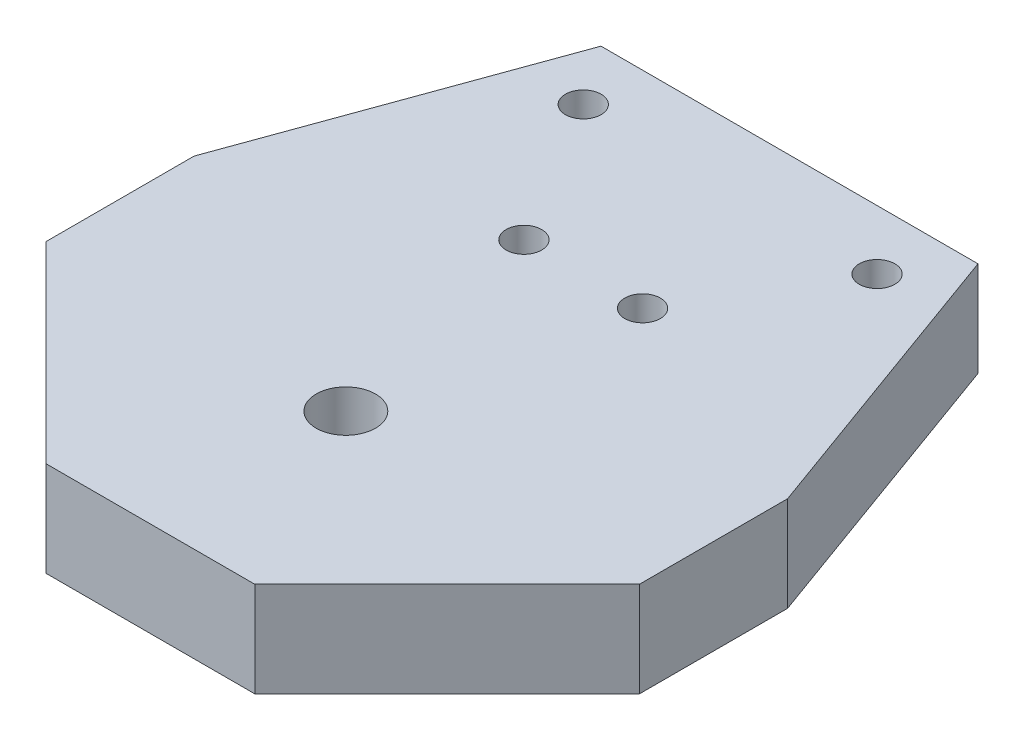
ISO-10303-21;
HEADER;
FILE_DESCRIPTION(('STEP AP214'),'2;1');
FILE_NAME('part.step','',(''),(''),'','','');
FILE_SCHEMA(('AUTOMOTIVE_DESIGN { 1 0 10303 214 1 1 1 1 }'));
ENDSEC;
DATA;
#1=APPLICATION_CONTEXT('core data for automotive mechanical design processes');
#2=APPLICATION_PROTOCOL_DEFINITION('international standard','automotive_design',2000,#1);
#3=PRODUCT_CONTEXT('',#1,'mechanical');
#4=PRODUCT('Part','Part','',(#3));
#5=PRODUCT_RELATED_PRODUCT_CATEGORY('part','',(#4));
#6=PRODUCT_DEFINITION_FORMATION('','',#4);
#7=PRODUCT_DEFINITION_CONTEXT('part definition',#1,'design');
#8=PRODUCT_DEFINITION('design','',#6,#7);
#9=PRODUCT_DEFINITION_SHAPE('','',#8);
#10=(LENGTH_UNIT() NAMED_UNIT(*) SI_UNIT(.MILLI.,.METRE.));
#11=(NAMED_UNIT(*) PLANE_ANGLE_UNIT() SI_UNIT($,.RADIAN.));
#12=(NAMED_UNIT(*) SI_UNIT($,.STERADIAN.) SOLID_ANGLE_UNIT());
#13=UNCERTAINTY_MEASURE_WITH_UNIT(LENGTH_MEASURE(1.E-05),#10,'distance_accuracy_value','');
#14=(GEOMETRIC_REPRESENTATION_CONTEXT(3) GLOBAL_UNCERTAINTY_ASSIGNED_CONTEXT((#13)) GLOBAL_UNIT_ASSIGNED_CONTEXT((#10,
#11,#12)) REPRESENTATION_CONTEXT('',''));
#15=CARTESIAN_POINT('',(0.,0.,0.));
#16=DIRECTION('',(0.,0.,1.));
#17=DIRECTION('',(1.,0.,0.));
#18=AXIS2_PLACEMENT_3D('',#15,#16,#17);
#19=CARTESIAN_POINT('',(0.,8.,0.));
#20=DIRECTION('',(0.,1.,0.));
#21=DIRECTION('',(0.,0.,1.));
#22=AXIS2_PLACEMENT_3D('',#19,#20,#21);
#23=PLANE('',#22);
#24=CARTESIAN_POINT('',(12.3763772695649,8.,-12.378899724008));
#25=DIRECTION('',(0.,1.,0.));
#26=DIRECTION('',(0.,0.,1.));
#27=AXIS2_PLACEMENT_3D('',#24,#25,#26);
#28=CIRCLE('',#27,1.5);
#29=CARTESIAN_POINT('',(12.3763772695649,8.,-10.878899724008));
#30=VERTEX_POINT('',#29);
#31=EDGE_CURVE('E235',#30,#30,#28,.T.);
#32=ORIENTED_EDGE('',*,*,#31,.F.);
#33=EDGE_LOOP('',(#32));
#34=FACE_BOUND('',#33,.T.);
#35=CARTESIAN_POINT('',(5.,8.,0.));
#36=DIRECTION('',(0.,1.,0.));
#37=DIRECTION('',(0.,0.,1.));
#38=AXIS2_PLACEMENT_3D('',#35,#36,#37);
#39=CIRCLE('',#38,1.5);
#40=CARTESIAN_POINT('',(5.,8.,1.5));
#41=VERTEX_POINT('',#40);
#42=EDGE_CURVE('E219',#41,#41,#39,.T.);
#43=ORIENTED_EDGE('',*,*,#42,.F.);
#44=EDGE_LOOP('',(#43));
#45=FACE_BOUND('',#44,.T.);
#46=DIRECTION('',(-0.340738579086975,0.,0.940158082835961));
#47=VECTOR('',#46,1.);
#48=CARTESIAN_POINT('',(-25.0018874247958,8.,7.78311257520442));
#49=LINE('',#48,#47);
#50=CARTESIAN_POINT('',(-15.8824973197398,8.,-17.378899724008));
#51=VERTEX_POINT('',#50);
#52=CARTESIAN_POINT('',(-25.0018874247958,8.,7.78311257520442));
#53=VERTEX_POINT('',#52);
#54=EDGE_CURVE('E170',#51,#53,#49,.T.);
#55=ORIENTED_EDGE('',*,*,#54,.T.);
#56=DIRECTION('',(0.,0.,1.));
#57=VECTOR('',#56,1.);
#58=CARTESIAN_POINT('',(-25.0018874247958,8.,20.2631125752044));
#59=LINE('',#58,#57);
#60=CARTESIAN_POINT('',(-25.0018874247958,8.,20.2631125752044));
#61=VERTEX_POINT('',#60);
#62=EDGE_CURVE('E106',#53,#61,#59,.T.);
#63=ORIENTED_EDGE('',*,*,#62,.T.);
#64=DIRECTION('',(0.707106781186551,0.,0.707106781186544));
#65=VECTOR('',#64,1.);
#66=CARTESIAN_POINT('',(-8.795,8.,36.47));
#67=LINE('',#66,#65);
#68=CARTESIAN_POINT('',(-8.795,8.,36.47));
#69=VERTEX_POINT('',#68);
#70=EDGE_CURVE('E191',#61,#69,#67,.T.);
#71=ORIENTED_EDGE('',*,*,#70,.T.);
#72=DIRECTION('',(1.,0.,0.));
#73=VECTOR('',#72,1.);
#74=CARTESIAN_POINT('',(-8.795,8.,36.47));
#75=LINE('',#74,#73);
#76=CARTESIAN_POINT('',(8.795,8.,36.47));
#77=VERTEX_POINT('',#76);
#78=EDGE_CURVE('E205',#69,#77,#75,.T.);
#79=ORIENTED_EDGE('',*,*,#78,.T.);
#80=DIRECTION('',(0.707106781186551,0.,-0.707106781186544));
#81=VECTOR('',#80,1.);
#82=CARTESIAN_POINT('',(8.795,8.,36.47));
#83=LINE('',#82,#81);
#84=CARTESIAN_POINT('',(25.0018874247958,8.,20.2631125752044));
#85=VERTEX_POINT('',#84);
#86=EDGE_CURVE('E125',#77,#85,#83,.T.);
#87=ORIENTED_EDGE('',*,*,#86,.T.);
#88=DIRECTION('',(0.,0.,-1.));
#89=VECTOR('',#88,1.);
#90=CARTESIAN_POINT('',(25.0018874247958,8.,20.2631125752044));
#91=LINE('',#90,#89);
#92=CARTESIAN_POINT('',(25.0018874247958,8.,7.78311257520442));
#93=VERTEX_POINT('',#92);
#94=EDGE_CURVE('E119',#85,#93,#91,.T.);
#95=ORIENTED_EDGE('',*,*,#94,.T.);
#96=DIRECTION('',(-0.340738579086975,0.,-0.940158082835961));
#97=VECTOR('',#96,1.);
#98=CARTESIAN_POINT('',(25.0018874247958,8.,7.78311257520442));
#99=LINE('',#98,#97);
#100=CARTESIAN_POINT('',(15.8824973197398,8.,-17.378899724008));
#101=VERTEX_POINT('',#100);
#102=EDGE_CURVE('E123',#93,#101,#99,.T.);
#103=ORIENTED_EDGE('',*,*,#102,.T.);
#104=DIRECTION('',(-1.,0.,0.));
#105=VECTOR('',#104,1.);
#106=CARTESIAN_POINT('',(15.8824973197398,8.,-17.378899724008));
#107=LINE('',#106,#105);
#108=EDGE_CURVE('E63',#101,#51,#107,.T.);
#109=ORIENTED_EDGE('',*,*,#108,.T.);
#110=EDGE_LOOP('',(#55,#63,#71,#79,#87,#95,#103,#109));
#111=FACE_BOUND('',#110,.T.);
#112=CARTESIAN_POINT('',(-5.,8.,0.));
#113=DIRECTION('',(0.,1.,0.));
#114=DIRECTION('',(0.,0.,1.));
#115=AXIS2_PLACEMENT_3D('',#112,#113,#114);
#116=CIRCLE('',#115,1.5);
#117=CARTESIAN_POINT('',(-5.,8.,1.5));
#118=VERTEX_POINT('',#117);
#119=EDGE_CURVE('E152',#118,#118,#116,.T.);
#120=ORIENTED_EDGE('',*,*,#119,.F.);
#121=EDGE_LOOP('',(#120));
#122=FACE_BOUND('',#121,.T.);
#123=CARTESIAN_POINT('',(0.,8.,20.));
#124=DIRECTION('',(0.,1.,0.));
#125=DIRECTION('',(0.,0.,1.));
#126=AXIS2_PLACEMENT_3D('',#123,#124,#125);
#127=CIRCLE('',#126,2.5);
#128=CARTESIAN_POINT('',(0.,8.,22.5));
#129=VERTEX_POINT('',#128);
#130=EDGE_CURVE('E227',#129,#129,#127,.T.);
#131=ORIENTED_EDGE('',*,*,#130,.F.);
#132=EDGE_LOOP('',(#131));
#133=FACE_BOUND('',#132,.T.);
#134=CARTESIAN_POINT('',(-12.3763772695649,8.,-12.378899724008));
#135=DIRECTION('',(0.,1.,0.));
#136=DIRECTION('',(0.,0.,-1.));
#137=AXIS2_PLACEMENT_3D('',#134,#135,#136);
#138=CIRCLE('',#137,1.5);
#139=CARTESIAN_POINT('',(-12.3763772695649,8.,-13.878899724008));
#140=VERTEX_POINT('',#139);
#141=EDGE_CURVE('E243',#140,#140,#138,.T.);
#142=ORIENTED_EDGE('',*,*,#141,.F.);
#143=EDGE_LOOP('',(#142));
#144=FACE_BOUND('',#143,.T.);
#145=ADVANCED_FACE('F45',(#34,#45,#111,#122,#133,#144),#23,.T.);
#146=CARTESIAN_POINT('',(0.,0.,0.));
#147=DIRECTION('',(0.,1.,0.));
#148=DIRECTION('',(0.,0.,1.));
#149=AXIS2_PLACEMENT_3D('',#146,#147,#148);
#150=PLANE('',#149);
#151=DIRECTION('',(-0.340738579086975,0.,0.940158082835961));
#152=VECTOR('',#151,1.);
#153=CARTESIAN_POINT('',(-25.0018874247958,0.,7.78311257520442));
#154=LINE('',#153,#152);
#155=CARTESIAN_POINT('',(-15.8824973197398,0.,-17.378899724008));
#156=VERTEX_POINT('',#155);
#157=CARTESIAN_POINT('',(-25.0018874247958,0.,7.78311257520442));
#158=VERTEX_POINT('',#157);
#159=EDGE_CURVE('E147',#156,#158,#154,.T.);
#160=ORIENTED_EDGE('',*,*,#159,.F.);
#161=DIRECTION('',(-1.,0.,0.));
#162=VECTOR('',#161,1.);
#163=CARTESIAN_POINT('',(15.8824973197398,0.,-17.378899724008));
#164=LINE('',#163,#162);
#165=CARTESIAN_POINT('',(15.8824973197398,0.,-17.378899724008));
#166=VERTEX_POINT('',#165);
#167=EDGE_CURVE('E98',#166,#156,#164,.T.);
#168=ORIENTED_EDGE('',*,*,#167,.F.);
#169=DIRECTION('',(-0.340738579086975,0.,-0.940158082835961));
#170=VECTOR('',#169,1.);
#171=CARTESIAN_POINT('',(25.0018874247958,0.,7.78311257520442));
#172=LINE('',#171,#170);
#173=CARTESIAN_POINT('',(25.0018874247958,0.,7.78311257520442));
#174=VERTEX_POINT('',#173);
#175=EDGE_CURVE('E92',#174,#166,#172,.T.);
#176=ORIENTED_EDGE('',*,*,#175,.F.);
#177=DIRECTION('',(0.,0.,-1.));
#178=VECTOR('',#177,1.);
#179=CARTESIAN_POINT('',(25.0018874247958,0.,20.2631125752044));
#180=LINE('',#179,#178);
#181=CARTESIAN_POINT('',(25.0018874247958,0.,20.2631125752044));
#182=VERTEX_POINT('',#181);
#183=EDGE_CURVE('E134',#182,#174,#180,.T.);
#184=ORIENTED_EDGE('',*,*,#183,.F.);
#185=DIRECTION('',(0.707106781186551,0.,-0.707106781186544));
#186=VECTOR('',#185,1.);
#187=CARTESIAN_POINT('',(8.795,0.,36.47));
#188=LINE('',#187,#186);
#189=CARTESIAN_POINT('',(8.795,0.,36.47));
#190=VERTEX_POINT('',#189);
#191=EDGE_CURVE('E161',#190,#182,#188,.T.);
#192=ORIENTED_EDGE('',*,*,#191,.F.);
#193=DIRECTION('',(1.,0.,0.));
#194=VECTOR('',#193,1.);
#195=CARTESIAN_POINT('',(-8.795,0.,36.47));
#196=LINE('',#195,#194);
#197=CARTESIAN_POINT('',(-8.795,0.,36.47));
#198=VERTEX_POINT('',#197);
#199=EDGE_CURVE('E158',#198,#190,#196,.T.);
#200=ORIENTED_EDGE('',*,*,#199,.F.);
#201=DIRECTION('',(0.707106781186551,0.,0.707106781186544));
#202=VECTOR('',#201,1.);
#203=CARTESIAN_POINT('',(-8.795,0.,36.47));
#204=LINE('',#203,#202);
#205=CARTESIAN_POINT('',(-25.0018874247958,0.,20.2631125752044));
#206=VERTEX_POINT('',#205);
#207=EDGE_CURVE('E155',#206,#198,#204,.T.);
#208=ORIENTED_EDGE('',*,*,#207,.F.);
#209=DIRECTION('',(0.,0.,1.));
#210=VECTOR('',#209,1.);
#211=CARTESIAN_POINT('',(-25.0018874247958,0.,20.2631125752044));
#212=LINE('',#211,#210);
#213=EDGE_CURVE('E151',#158,#206,#212,.T.);
#214=ORIENTED_EDGE('',*,*,#213,.F.);
#215=EDGE_LOOP('',(#160,#168,#176,#184,#192,#200,#208,#214));
#216=FACE_BOUND('',#215,.T.);
#217=CARTESIAN_POINT('',(-5.,0.,0.));
#218=DIRECTION('',(0.,1.,0.));
#219=DIRECTION('',(0.,0.,1.));
#220=AXIS2_PLACEMENT_3D('',#217,#218,#219);
#221=CIRCLE('',#220,1.5);
#222=CARTESIAN_POINT('',(-5.,0.,1.5));
#223=VERTEX_POINT('',#222);
#224=EDGE_CURVE('E215',#223,#223,#221,.T.);
#225=ORIENTED_EDGE('',*,*,#224,.T.);
#226=EDGE_LOOP('',(#225));
#227=FACE_BOUND('',#226,.T.);
#228=CARTESIAN_POINT('',(5.,0.,0.));
#229=DIRECTION('',(0.,1.,0.));
#230=DIRECTION('',(0.,0.,1.));
#231=AXIS2_PLACEMENT_3D('',#228,#229,#230);
#232=CIRCLE('',#231,1.5);
#233=CARTESIAN_POINT('',(5.,0.,1.5));
#234=VERTEX_POINT('',#233);
#235=EDGE_CURVE('E223',#234,#234,#232,.T.);
#236=ORIENTED_EDGE('',*,*,#235,.T.);
#237=EDGE_LOOP('',(#236));
#238=FACE_BOUND('',#237,.T.);
#239=CARTESIAN_POINT('',(0.,0.,20.));
#240=DIRECTION('',(0.,1.,0.));
#241=DIRECTION('',(0.,0.,1.));
#242=AXIS2_PLACEMENT_3D('',#239,#240,#241);
#243=CIRCLE('',#242,2.5);
#244=CARTESIAN_POINT('',(0.,0.,22.5));
#245=VERTEX_POINT('',#244);
#246=EDGE_CURVE('E231',#245,#245,#243,.T.);
#247=ORIENTED_EDGE('',*,*,#246,.T.);
#248=EDGE_LOOP('',(#247));
#249=FACE_BOUND('',#248,.T.);
#250=CARTESIAN_POINT('',(12.3763772695649,0.,-12.378899724008));
#251=DIRECTION('',(0.,1.,0.));
#252=DIRECTION('',(0.,0.,1.));
#253=AXIS2_PLACEMENT_3D('',#250,#251,#252);
#254=CIRCLE('',#253,1.5);
#255=CARTESIAN_POINT('',(12.3763772695649,0.,-10.878899724008));
#256=VERTEX_POINT('',#255);
#257=EDGE_CURVE('E239',#256,#256,#254,.T.);
#258=ORIENTED_EDGE('',*,*,#257,.T.);
#259=EDGE_LOOP('',(#258));
#260=FACE_BOUND('',#259,.T.);
#261=CARTESIAN_POINT('',(-12.3763772695649,0.,-12.378899724008));
#262=DIRECTION('',(0.,1.,0.));
#263=DIRECTION('',(0.,0.,-1.));
#264=AXIS2_PLACEMENT_3D('',#261,#262,#263);
#265=CIRCLE('',#264,1.5);
#266=CARTESIAN_POINT('',(-12.3763772695649,0.,-13.878899724008));
#267=VERTEX_POINT('',#266);
#268=EDGE_CURVE('E247',#267,#267,#265,.T.);
#269=ORIENTED_EDGE('',*,*,#268,.T.);
#270=EDGE_LOOP('',(#269));
#271=FACE_BOUND('',#270,.T.);
#272=ADVANCED_FACE('F195',(#216,#227,#238,#249,#260,#271),#150,.F.);
#273=CARTESIAN_POINT('',(-25.0018874247958,8.,7.78311257520442));
#274=DIRECTION('',(0.940158082835961,0.,0.340738579086975));
#275=DIRECTION('',(0.340738579086975,0.,-0.940158082835961));
#276=AXIS2_PLACEMENT_3D('',#273,#274,#275);
#277=PLANE('',#276);
#278=ORIENTED_EDGE('',*,*,#159,.T.);
#279=DIRECTION('',(0.,-1.,0.));
#280=VECTOR('',#279,1.);
#281=CARTESIAN_POINT('',(-25.0018874247958,8.,7.78311257520442));
#282=LINE('',#281,#280);
#283=EDGE_CURVE('E11',#53,#158,#282,.T.);
#284=ORIENTED_EDGE('',*,*,#283,.F.);
#285=ORIENTED_EDGE('',*,*,#54,.F.);
#286=DIRECTION('',(0.,-1.,0.));
#287=VECTOR('',#286,1.);
#288=CARTESIAN_POINT('',(-15.8824973197398,8.,-17.378899724008));
#289=LINE('',#288,#287);
#290=EDGE_CURVE('E143',#51,#156,#289,.T.);
#291=ORIENTED_EDGE('',*,*,#290,.T.);
#292=EDGE_LOOP('',(#278,#284,#285,#291));
#293=FACE_BOUND('',#292,.T.);
#294=ADVANCED_FACE('F47',(#293),#277,.F.);
#295=CARTESIAN_POINT('',(-25.0018874247958,8.,20.2631125752044));
#296=DIRECTION('',(1.,0.,0.));
#297=DIRECTION('',(0.,0.,-1.));
#298=AXIS2_PLACEMENT_3D('',#295,#296,#297);
#299=PLANE('',#298);
#300=ORIENTED_EDGE('',*,*,#213,.T.);
#301=DIRECTION('',(0.,-1.,0.));
#302=VECTOR('',#301,1.);
#303=CARTESIAN_POINT('',(-25.0018874247958,8.,20.2631125752044));
#304=LINE('',#303,#302);
#305=EDGE_CURVE('E55',#61,#206,#304,.T.);
#306=ORIENTED_EDGE('',*,*,#305,.F.);
#307=ORIENTED_EDGE('',*,*,#62,.F.);
#308=ORIENTED_EDGE('',*,*,#283,.T.);
#309=EDGE_LOOP('',(#300,#306,#307,#308));
#310=FACE_BOUND('',#309,.T.);
#311=ADVANCED_FACE('F283',(#310),#299,.F.);
#312=CARTESIAN_POINT('',(-8.795,8.,36.47));
#313=DIRECTION('',(0.707106781186544,0.,-0.707106781186551));
#314=DIRECTION('',(-0.707106781186551,0.,-0.707106781186544));
#315=AXIS2_PLACEMENT_3D('',#312,#313,#314);
#316=PLANE('',#315);
#317=ORIENTED_EDGE('',*,*,#207,.T.);
#318=DIRECTION('',(0.,-1.,0.));
#319=VECTOR('',#318,1.);
#320=CARTESIAN_POINT('',(-8.795,8.,36.47));
#321=LINE('',#320,#319);
#322=EDGE_CURVE('E181',#69,#198,#321,.T.);
#323=ORIENTED_EDGE('',*,*,#322,.F.);
#324=ORIENTED_EDGE('',*,*,#70,.F.);
#325=ORIENTED_EDGE('',*,*,#305,.T.);
#326=EDGE_LOOP('',(#317,#323,#324,#325));
#327=FACE_BOUND('',#326,.T.);
#328=ADVANCED_FACE('F189',(#327),#316,.F.);
#329=CARTESIAN_POINT('',(-8.795,8.,36.47));
#330=DIRECTION('',(0.,0.,-1.));
#331=DIRECTION('',(-1.,0.,0.));
#332=AXIS2_PLACEMENT_3D('',#329,#330,#331);
#333=PLANE('',#332);
#334=ORIENTED_EDGE('',*,*,#199,.T.);
#335=DIRECTION('',(0.,-1.,0.));
#336=VECTOR('',#335,1.);
#337=CARTESIAN_POINT('',(8.795,8.,36.47));
#338=LINE('',#337,#336);
#339=EDGE_CURVE('E177',#77,#190,#338,.T.);
#340=ORIENTED_EDGE('',*,*,#339,.F.);
#341=ORIENTED_EDGE('',*,*,#78,.F.);
#342=ORIENTED_EDGE('',*,*,#322,.T.);
#343=EDGE_LOOP('',(#334,#340,#341,#342));
#344=FACE_BOUND('',#343,.T.);
#345=ADVANCED_FACE('F200',(#344),#333,.F.);
#346=CARTESIAN_POINT('',(8.795,8.,36.47));
#347=DIRECTION('',(-0.707106781186544,0.,-0.707106781186551));
#348=DIRECTION('',(-0.707106781186551,0.,0.707106781186544));
#349=AXIS2_PLACEMENT_3D('',#346,#347,#348);
#350=PLANE('',#349);
#351=ORIENTED_EDGE('',*,*,#191,.T.);
#352=DIRECTION('',(0.,-1.,0.));
#353=VECTOR('',#352,1.);
#354=CARTESIAN_POINT('',(25.0018874247958,8.,20.2631125752044));
#355=LINE('',#354,#353);
#356=EDGE_CURVE('E136',#85,#182,#355,.T.);
#357=ORIENTED_EDGE('',*,*,#356,.F.);
#358=ORIENTED_EDGE('',*,*,#86,.F.);
#359=ORIENTED_EDGE('',*,*,#339,.T.);
#360=EDGE_LOOP('',(#351,#357,#358,#359));
#361=FACE_BOUND('',#360,.T.);
#362=ADVANCED_FACE('F203',(#361),#350,.F.);
#363=CARTESIAN_POINT('',(25.0018874247958,8.,20.2631125752044));
#364=DIRECTION('',(-1.,0.,0.));
#365=DIRECTION('',(0.,0.,1.));
#366=AXIS2_PLACEMENT_3D('',#363,#364,#365);
#367=PLANE('',#366);
#368=ORIENTED_EDGE('',*,*,#183,.T.);
#369=DIRECTION('',(0.,-1.,0.));
#370=VECTOR('',#369,1.);
#371=CARTESIAN_POINT('',(25.0018874247958,8.,7.78311257520442));
#372=LINE('',#371,#370);
#373=EDGE_CURVE('E131',#93,#174,#372,.T.);
#374=ORIENTED_EDGE('',*,*,#373,.F.);
#375=ORIENTED_EDGE('',*,*,#94,.F.);
#376=ORIENTED_EDGE('',*,*,#356,.T.);
#377=EDGE_LOOP('',(#368,#374,#375,#376));
#378=FACE_BOUND('',#377,.T.);
#379=ADVANCED_FACE('F132',(#378),#367,.F.);
#380=CARTESIAN_POINT('',(25.0018874247958,8.,7.78311257520442));
#381=DIRECTION('',(-0.940158082835961,0.,0.340738579086975));
#382=DIRECTION('',(0.340738579086975,0.,0.940158082835961));
#383=AXIS2_PLACEMENT_3D('',#380,#381,#382);
#384=PLANE('',#383);
#385=ORIENTED_EDGE('',*,*,#175,.T.);
#386=DIRECTION('',(0.,-1.,0.));
#387=VECTOR('',#386,1.);
#388=CARTESIAN_POINT('',(15.8824973197398,8.,-17.378899724008));
#389=LINE('',#388,#387);
#390=EDGE_CURVE('E137',#101,#166,#389,.T.);
#391=ORIENTED_EDGE('',*,*,#390,.F.);
#392=ORIENTED_EDGE('',*,*,#102,.F.);
#393=ORIENTED_EDGE('',*,*,#373,.T.);
#394=EDGE_LOOP('',(#385,#391,#392,#393));
#395=FACE_BOUND('',#394,.T.);
#396=ADVANCED_FACE('F139',(#395),#384,.F.);
#397=CARTESIAN_POINT('',(15.8824973197398,8.,-17.378899724008));
#398=DIRECTION('',(0.,0.,1.));
#399=DIRECTION('',(1.,0.,0.));
#400=AXIS2_PLACEMENT_3D('',#397,#398,#399);
#401=PLANE('',#400);
#402=ORIENTED_EDGE('',*,*,#167,.T.);
#403=ORIENTED_EDGE('',*,*,#290,.F.);
#404=ORIENTED_EDGE('',*,*,#108,.F.);
#405=ORIENTED_EDGE('',*,*,#390,.T.);
#406=EDGE_LOOP('',(#402,#403,#404,#405));
#407=FACE_BOUND('',#406,.T.);
#408=ADVANCED_FACE('F271',(#407),#401,.F.);
#409=CARTESIAN_POINT('',(-5.,8.,0.));
#410=DIRECTION('',(0.,-1.,0.));
#411=DIRECTION('',(0.,0.,-1.));
#412=AXIS2_PLACEMENT_3D('',#409,#410,#411);
#413=CYLINDRICAL_SURFACE('',#412,1.5);
#414=ORIENTED_EDGE('',*,*,#119,.T.);
#415=EDGE_LOOP('',(#414));
#416=FACE_BOUND('',#415,.T.);
#417=ORIENTED_EDGE('',*,*,#224,.F.);
#418=EDGE_LOOP('',(#417));
#419=FACE_BOUND('',#418,.T.);
#420=ADVANCED_FACE('F268',(#416,#419),#413,.F.);
#421=CARTESIAN_POINT('',(5.,8.,0.));
#422=DIRECTION('',(0.,-1.,0.));
#423=DIRECTION('',(0.,0.,-1.));
#424=AXIS2_PLACEMENT_3D('',#421,#422,#423);
#425=CYLINDRICAL_SURFACE('',#424,1.5);
#426=ORIENTED_EDGE('',*,*,#42,.T.);
#427=EDGE_LOOP('',(#426));
#428=FACE_BOUND('',#427,.T.);
#429=ORIENTED_EDGE('',*,*,#235,.F.);
#430=EDGE_LOOP('',(#429));
#431=FACE_BOUND('',#430,.T.);
#432=ADVANCED_FACE('F346',(#428,#431),#425,.F.);
#433=CARTESIAN_POINT('',(0.,8.,20.));
#434=DIRECTION('',(0.,-1.,0.));
#435=DIRECTION('',(0.,0.,-1.));
#436=AXIS2_PLACEMENT_3D('',#433,#434,#435);
#437=CYLINDRICAL_SURFACE('',#436,2.5);
#438=ORIENTED_EDGE('',*,*,#130,.T.);
#439=EDGE_LOOP('',(#438));
#440=FACE_BOUND('',#439,.T.);
#441=ORIENTED_EDGE('',*,*,#246,.F.);
#442=EDGE_LOOP('',(#441));
#443=FACE_BOUND('',#442,.T.);
#444=ADVANCED_FACE('F354',(#440,#443),#437,.F.);
#445=CARTESIAN_POINT('',(12.3763772695649,8.,-12.378899724008));
#446=DIRECTION('',(0.,-1.,0.));
#447=DIRECTION('',(0.,0.,-1.));
#448=AXIS2_PLACEMENT_3D('',#445,#446,#447);
#449=CYLINDRICAL_SURFACE('',#448,1.5);
#450=ORIENTED_EDGE('',*,*,#31,.T.);
#451=EDGE_LOOP('',(#450));
#452=FACE_BOUND('',#451,.T.);
#453=ORIENTED_EDGE('',*,*,#257,.F.);
#454=EDGE_LOOP('',(#453));
#455=FACE_BOUND('',#454,.T.);
#456=ADVANCED_FACE('F362',(#452,#455),#449,.F.);
#457=CARTESIAN_POINT('',(-12.3763772695649,8.,-12.378899724008));
#458=DIRECTION('',(0.,-1.,0.));
#459=DIRECTION('',(0.,0.,-1.));
#460=AXIS2_PLACEMENT_3D('',#457,#458,#459);
#461=CYLINDRICAL_SURFACE('',#460,1.5);
#462=ORIENTED_EDGE('',*,*,#141,.T.);
#463=EDGE_LOOP('',(#462));
#464=FACE_BOUND('',#463,.T.);
#465=ORIENTED_EDGE('',*,*,#268,.F.);
#466=EDGE_LOOP('',(#465));
#467=FACE_BOUND('',#466,.T.);
#468=ADVANCED_FACE('F255',(#464,#467),#461,.F.);
#469=CLOSED_SHELL('',(#145,#272,#294,#311,#328,#345,#362,#379,#396,#408,#420,#432,#444,#456,#468));
#470=MANIFOLD_SOLID_BREP('B2',#469);
#471=ADVANCED_BREP_SHAPE_REPRESENTATION('',(#18,#470),#14);
#472=SHAPE_DEFINITION_REPRESENTATION(#9,#471);
ENDSEC;
END-ISO-10303-21;
